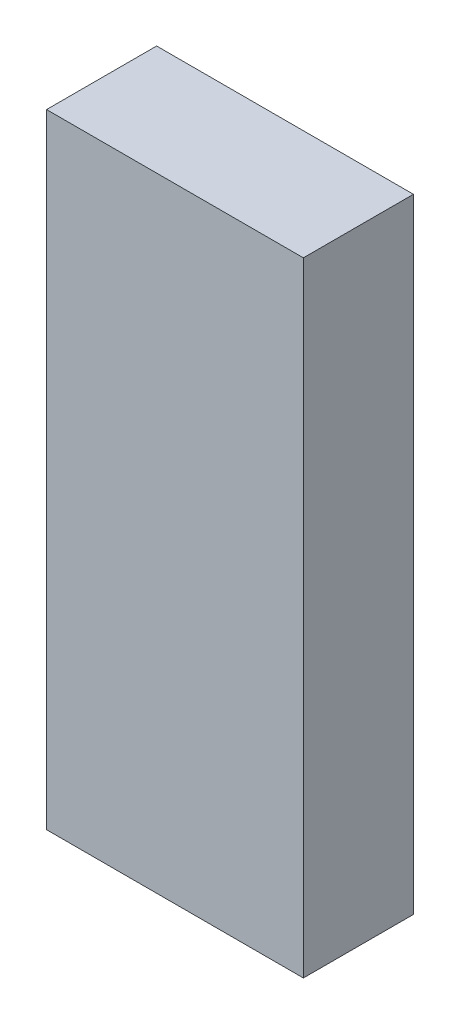
ISO-10303-21;
HEADER;
FILE_DESCRIPTION(('STEP AP214'),'2;1');
FILE_NAME('part.step','',(''),(''),'','','');
FILE_SCHEMA(('AUTOMOTIVE_DESIGN { 1 0 10303 214 1 1 1 1 }'));
ENDSEC;
DATA;
#1=APPLICATION_CONTEXT('core data for automotive mechanical design processes');
#2=APPLICATION_PROTOCOL_DEFINITION('international standard','automotive_design',2000,#1);
#3=PRODUCT_CONTEXT('',#1,'mechanical');
#4=PRODUCT('Part','Part','',(#3));
#5=PRODUCT_RELATED_PRODUCT_CATEGORY('part','',(#4));
#6=PRODUCT_DEFINITION_FORMATION('','',#4);
#7=PRODUCT_DEFINITION_CONTEXT('part definition',#1,'design');
#8=PRODUCT_DEFINITION('design','',#6,#7);
#9=PRODUCT_DEFINITION_SHAPE('','',#8);
#10=(LENGTH_UNIT() NAMED_UNIT(*) SI_UNIT(.MILLI.,.METRE.));
#11=(NAMED_UNIT(*) PLANE_ANGLE_UNIT() SI_UNIT($,.RADIAN.));
#12=(NAMED_UNIT(*) SI_UNIT($,.STERADIAN.) SOLID_ANGLE_UNIT());
#13=UNCERTAINTY_MEASURE_WITH_UNIT(LENGTH_MEASURE(1.E-05),#10,'distance_accuracy_value','');
#14=(GEOMETRIC_REPRESENTATION_CONTEXT(3) GLOBAL_UNCERTAINTY_ASSIGNED_CONTEXT((#13)) GLOBAL_UNIT_ASSIGNED_CONTEXT((#10,
#11,#12)) REPRESENTATION_CONTEXT('',''));
#15=CARTESIAN_POINT('',(0.,0.,0.));
#16=DIRECTION('',(0.,0.,1.));
#17=DIRECTION('',(1.,0.,0.));
#18=AXIS2_PLACEMENT_3D('',#15,#16,#17);
#19=CARTESIAN_POINT('',(44.45,215.9,-19.05));
#20=DIRECTION('',(-1.,0.,0.));
#21=DIRECTION('',(0.,0.,1.));
#22=AXIS2_PLACEMENT_3D('',#19,#20,#21);
#23=PLANE('',#22);
#24=DIRECTION('',(0.,0.,-1.));
#25=VECTOR('',#24,1.);
#26=CARTESIAN_POINT('',(44.45,0.,-19.05));
#27=LINE('',#26,#25);
#28=CARTESIAN_POINT('',(44.45,0.,19.05));
#29=VERTEX_POINT('',#28);
#30=CARTESIAN_POINT('',(44.45,0.,-19.05));
#31=VERTEX_POINT('',#30);
#32=EDGE_CURVE('E96',#29,#31,#27,.T.);
#33=ORIENTED_EDGE('',*,*,#32,.T.);
#34=DIRECTION('',(0.,-1.,0.));
#35=VECTOR('',#34,1.);
#36=CARTESIAN_POINT('',(44.45,215.9,-19.05));
#37=LINE('',#36,#35);
#38=CARTESIAN_POINT('',(44.45,215.9,-19.05));
#39=VERTEX_POINT('',#38);
#40=EDGE_CURVE('E11',#39,#31,#37,.T.);
#41=ORIENTED_EDGE('',*,*,#40,.F.);
#42=DIRECTION('',(0.,0.,-1.));
#43=VECTOR('',#42,1.);
#44=CARTESIAN_POINT('',(44.45,215.9,-19.05));
#45=LINE('',#44,#43);
#46=CARTESIAN_POINT('',(44.45,215.9,19.05));
#47=VERTEX_POINT('',#46);
#48=EDGE_CURVE('E84',#47,#39,#45,.T.);
#49=ORIENTED_EDGE('',*,*,#48,.F.);
#50=DIRECTION('',(0.,-1.,0.));
#51=VECTOR('',#50,1.);
#52=CARTESIAN_POINT('',(44.45,215.9,19.05));
#53=LINE('',#52,#51);
#54=EDGE_CURVE('E92',#47,#29,#53,.T.);
#55=ORIENTED_EDGE('',*,*,#54,.T.);
#56=EDGE_LOOP('',(#33,#41,#49,#55));
#57=FACE_BOUND('',#56,.T.);
#58=ADVANCED_FACE('F33',(#57),#23,.F.);
#59=CARTESIAN_POINT('',(-44.45,215.9,-19.05));
#60=DIRECTION('',(0.,0.,1.));
#61=DIRECTION('',(1.,0.,0.));
#62=AXIS2_PLACEMENT_3D('',#59,#60,#61);
#63=PLANE('',#62);
#64=DIRECTION('',(-1.,0.,0.));
#65=VECTOR('',#64,1.);
#66=CARTESIAN_POINT('',(-44.45,0.,-19.05));
#67=LINE('',#66,#65);
#68=CARTESIAN_POINT('',(-44.45,0.,-19.05));
#69=VERTEX_POINT('',#68);
#70=EDGE_CURVE('E88',#31,#69,#67,.T.);
#71=ORIENTED_EDGE('',*,*,#70,.T.);
#72=DIRECTION('',(0.,-1.,0.));
#73=VECTOR('',#72,1.);
#74=CARTESIAN_POINT('',(-44.45,215.9,-19.05));
#75=LINE('',#74,#73);
#76=CARTESIAN_POINT('',(-44.45,215.9,-19.05));
#77=VERTEX_POINT('',#76);
#78=EDGE_CURVE('E41',#77,#69,#75,.T.);
#79=ORIENTED_EDGE('',*,*,#78,.F.);
#80=DIRECTION('',(-1.,0.,0.));
#81=VECTOR('',#80,1.);
#82=CARTESIAN_POINT('',(-44.45,215.9,-19.05));
#83=LINE('',#82,#81);
#84=EDGE_CURVE('E79',#39,#77,#83,.T.);
#85=ORIENTED_EDGE('',*,*,#84,.F.);
#86=ORIENTED_EDGE('',*,*,#40,.T.);
#87=EDGE_LOOP('',(#71,#79,#85,#86));
#88=FACE_BOUND('',#87,.T.);
#89=ADVANCED_FACE('F87',(#88),#63,.F.);
#90=CARTESIAN_POINT('',(-44.45,215.9,-19.05));
#91=DIRECTION('',(1.,0.,0.));
#92=DIRECTION('',(0.,0.,-1.));
#93=AXIS2_PLACEMENT_3D('',#90,#91,#92);
#94=PLANE('',#93);
#95=DIRECTION('',(0.,0.,1.));
#96=VECTOR('',#95,1.);
#97=CARTESIAN_POINT('',(-44.45,0.,-19.05));
#98=LINE('',#97,#96);
#99=CARTESIAN_POINT('',(-44.45,0.,19.05));
#100=VERTEX_POINT('',#99);
#101=EDGE_CURVE('E66',#69,#100,#98,.T.);
#102=ORIENTED_EDGE('',*,*,#101,.T.);
#103=DIRECTION('',(0.,-1.,0.));
#104=VECTOR('',#103,1.);
#105=CARTESIAN_POINT('',(-44.45,215.9,19.05));
#106=LINE('',#105,#104);
#107=CARTESIAN_POINT('',(-44.45,215.9,19.05));
#108=VERTEX_POINT('',#107);
#109=EDGE_CURVE('E89',#108,#100,#106,.T.);
#110=ORIENTED_EDGE('',*,*,#109,.F.);
#111=DIRECTION('',(0.,0.,1.));
#112=VECTOR('',#111,1.);
#113=CARTESIAN_POINT('',(-44.45,215.9,-19.05));
#114=LINE('',#113,#112);
#115=EDGE_CURVE('E82',#77,#108,#114,.T.);
#116=ORIENTED_EDGE('',*,*,#115,.F.);
#117=ORIENTED_EDGE('',*,*,#78,.T.);
#118=EDGE_LOOP('',(#102,#110,#116,#117));
#119=FACE_BOUND('',#118,.T.);
#120=ADVANCED_FACE('F90',(#119),#94,.F.);
#121=CARTESIAN_POINT('',(-44.45,215.9,19.05));
#122=DIRECTION('',(0.,0.,-1.));
#123=DIRECTION('',(-1.,0.,0.));
#124=AXIS2_PLACEMENT_3D('',#121,#122,#123);
#125=PLANE('',#124);
#126=DIRECTION('',(1.,0.,0.));
#127=VECTOR('',#126,1.);
#128=CARTESIAN_POINT('',(-44.45,0.,19.05));
#129=LINE('',#128,#127);
#130=EDGE_CURVE('E72',#100,#29,#129,.T.);
#131=ORIENTED_EDGE('',*,*,#130,.T.);
#132=ORIENTED_EDGE('',*,*,#54,.F.);
#133=DIRECTION('',(1.,0.,0.));
#134=VECTOR('',#133,1.);
#135=CARTESIAN_POINT('',(-44.45,215.9,19.05));
#136=LINE('',#135,#134);
#137=EDGE_CURVE('E49',#108,#47,#136,.T.);
#138=ORIENTED_EDGE('',*,*,#137,.F.);
#139=ORIENTED_EDGE('',*,*,#109,.T.);
#140=EDGE_LOOP('',(#131,#132,#138,#139));
#141=FACE_BOUND('',#140,.T.);
#142=ADVANCED_FACE('F103',(#141),#125,.F.);
#143=CARTESIAN_POINT('',(0.,215.9,0.));
#144=DIRECTION('',(0.,1.,0.));
#145=DIRECTION('',(0.,0.,1.));
#146=AXIS2_PLACEMENT_3D('',#143,#144,#145);
#147=PLANE('',#146);
#148=ORIENTED_EDGE('',*,*,#48,.T.);
#149=ORIENTED_EDGE('',*,*,#84,.T.);
#150=ORIENTED_EDGE('',*,*,#115,.T.);
#151=ORIENTED_EDGE('',*,*,#137,.T.);
#152=EDGE_LOOP('',(#148,#149,#150,#151));
#153=FACE_BOUND('',#152,.T.);
#154=ADVANCED_FACE('F80',(#153),#147,.T.);
#155=CARTESIAN_POINT('',(0.,0.,0.));
#156=DIRECTION('',(0.,1.,0.));
#157=DIRECTION('',(0.,0.,1.));
#158=AXIS2_PLACEMENT_3D('',#155,#156,#157);
#159=PLANE('',#158);
#160=ORIENTED_EDGE('',*,*,#32,.F.);
#161=ORIENTED_EDGE('',*,*,#130,.F.);
#162=ORIENTED_EDGE('',*,*,#101,.F.);
#163=ORIENTED_EDGE('',*,*,#70,.F.);
#164=EDGE_LOOP('',(#160,#161,#162,#163));
#165=FACE_BOUND('',#164,.T.);
#166=ADVANCED_FACE('F106',(#165),#159,.F.);
#167=CLOSED_SHELL('',(#58,#89,#120,#142,#154,#166));
#168=MANIFOLD_SOLID_BREP('B2',#167);
#169=ADVANCED_BREP_SHAPE_REPRESENTATION('',(#18,#168),#14);
#170=SHAPE_DEFINITION_REPRESENTATION(#9,#169);
ENDSEC;
END-ISO-10303-21;
